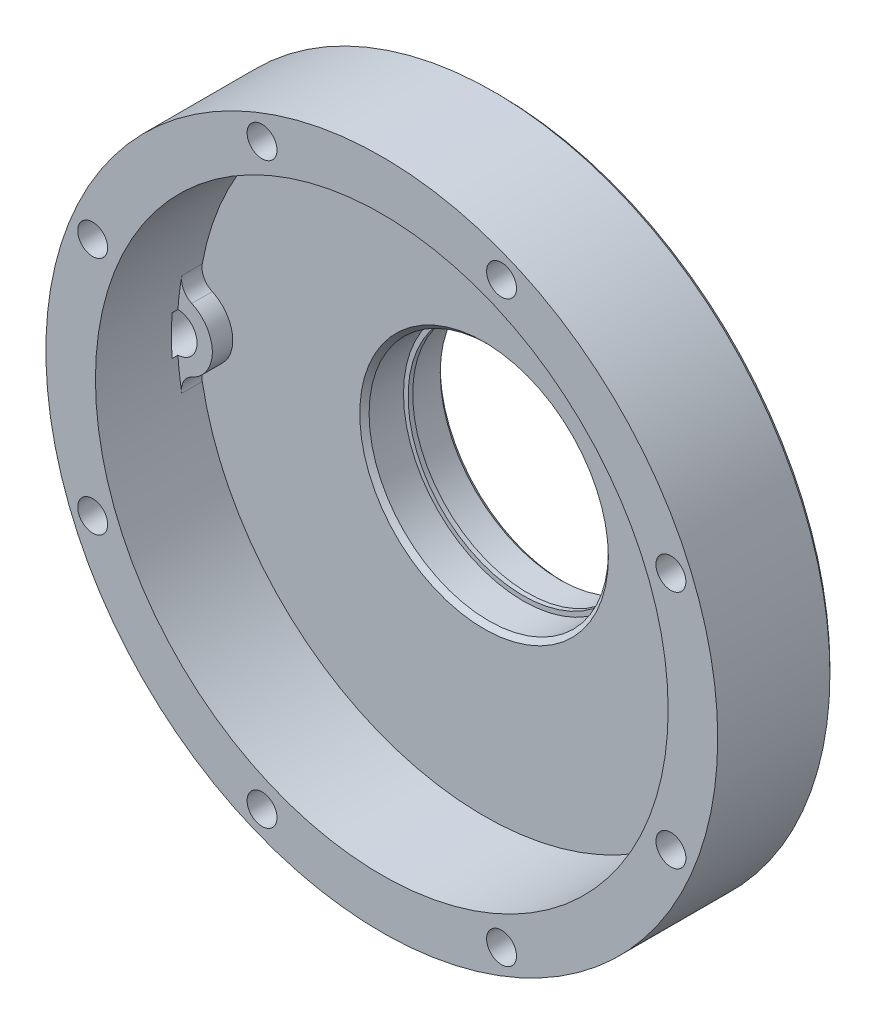
ISO-10303-21;
HEADER;
FILE_DESCRIPTION(('STEP AP214'),'2;1');
FILE_NAME('part.step','',(''),(''),'','','');
FILE_SCHEMA(('AUTOMOTIVE_DESIGN { 1 0 10303 214 1 1 1 1 }'));
ENDSEC;
DATA;
#1=APPLICATION_CONTEXT('core data for automotive mechanical design processes');
#2=APPLICATION_PROTOCOL_DEFINITION('international standard','automotive_design',2000,#1);
#3=PRODUCT_CONTEXT('',#1,'mechanical');
#4=PRODUCT('Part','Part','',(#3));
#5=PRODUCT_RELATED_PRODUCT_CATEGORY('part','',(#4));
#6=PRODUCT_DEFINITION_FORMATION('','',#4);
#7=PRODUCT_DEFINITION_CONTEXT('part definition',#1,'design');
#8=PRODUCT_DEFINITION('design','',#6,#7);
#9=PRODUCT_DEFINITION_SHAPE('','',#8);
#10=(LENGTH_UNIT() NAMED_UNIT(*) SI_UNIT(.MILLI.,.METRE.));
#11=(NAMED_UNIT(*) PLANE_ANGLE_UNIT() SI_UNIT($,.RADIAN.));
#12=(NAMED_UNIT(*) SI_UNIT($,.STERADIAN.) SOLID_ANGLE_UNIT());
#13=UNCERTAINTY_MEASURE_WITH_UNIT(LENGTH_MEASURE(1.E-05),#10,'distance_accuracy_value','');
#14=(GEOMETRIC_REPRESENTATION_CONTEXT(3) GLOBAL_UNCERTAINTY_ASSIGNED_CONTEXT((#13)) GLOBAL_UNIT_ASSIGNED_CONTEXT((#10,
#11,#12)) REPRESENTATION_CONTEXT('',''));
#15=CARTESIAN_POINT('',(0.,0.,0.));
#16=DIRECTION('',(0.,0.,1.));
#17=DIRECTION('',(1.,0.,0.));
#18=AXIS2_PLACEMENT_3D('',#15,#16,#17);
#19=CARTESIAN_POINT('',(0.,0.,-11.6725321845407));
#20=DIRECTION('',(0.,0.,-1.));
#21=DIRECTION('',(-1.,0.,0.));
#22=AXIS2_PLACEMENT_3D('',#19,#20,#21);
#23=PLANE('',#22);
#24=CARTESIAN_POINT('',(-10.3994360530147,57.4869387755102,-11.6725321845407));
#25=DIRECTION('',(0.,0.,1.));
#26=DIRECTION('',(1.,0.,0.));
#27=AXIS2_PLACEMENT_3D('',#24,#25,#26);
#28=CIRCLE('',#27,3.80999999999999);
#29=CARTESIAN_POINT('',(-11.0776601434287,61.2360869565217,-11.6725321845407));
#30=VERTEX_POINT('',#29);
#31=CARTESIAN_POINT('',(-6.93295736867645,59.0679591836735,-11.6725321845407));
#32=VERTEX_POINT('',#31);
#33=EDGE_CURVE('E52',#30,#32,#28,.F.);
#34=ORIENTED_EDGE('',*,*,#33,.T.);
#35=CARTESIAN_POINT('',(0.,62.23,-11.6725321845407));
#36=DIRECTION('',(0.,0.,1.));
#37=DIRECTION('',(1.,0.,0.));
#38=AXIS2_PLACEMENT_3D('',#35,#36,#37);
#39=CIRCLE('',#38,7.62);
#40=CARTESIAN_POINT('',(6.93295736867645,59.0679591836735,-11.6725321845407));
#41=VERTEX_POINT('',#40);
#42=EDGE_CURVE('E288',#32,#41,#39,.T.);
#43=ORIENTED_EDGE('',*,*,#42,.T.);
#44=CARTESIAN_POINT('',(10.3994360530147,57.4869387755102,-11.6725321845407));
#45=DIRECTION('',(0.,0.,1.));
#46=DIRECTION('',(1.,0.,0.));
#47=AXIS2_PLACEMENT_3D('',#44,#45,#46);
#48=CIRCLE('',#47,3.80999999999999);
#49=CARTESIAN_POINT('',(11.0776601434287,61.2360869565217,-11.6725321845407));
#50=VERTEX_POINT('',#49);
#51=EDGE_CURVE('E303',#50,#41,#48,.T.);
#52=ORIENTED_EDGE('',*,*,#51,.F.);
#53=CARTESIAN_POINT('',(0.,0.,-11.6725321845407));
#54=DIRECTION('',(0.,0.,1.));
#55=DIRECTION('',(1.,0.,0.));
#56=AXIS2_PLACEMENT_3D('',#53,#54,#55);
#57=CIRCLE('',#56,62.23);
#58=CARTESIAN_POINT('',(4.30272337838614,62.0810717653061,-11.6725321845407));
#59=VERTEX_POINT('',#58);
#60=EDGE_CURVE('E157',#50,#59,#57,.T.);
#61=ORIENTED_EDGE('',*,*,#60,.T.);
#62=CARTESIAN_POINT('',(0.,62.23,-11.6725321845407));
#63=DIRECTION('',(0.,0.,-1.));
#64=DIRECTION('',(-1.,0.,0.));
#65=AXIS2_PLACEMENT_3D('',#62,#63,#64);
#66=CIRCLE('',#65,4.30530000000001);
#67=CARTESIAN_POINT('',(-4.30272337838614,62.0810717653061,-11.6725321845407));
#68=VERTEX_POINT('',#67);
#69=EDGE_CURVE('E267',#59,#68,#66,.T.);
#70=ORIENTED_EDGE('',*,*,#69,.T.);
#71=EDGE_CURVE('E154',#68,#30,#57,.T.);
#72=ORIENTED_EDGE('',*,*,#71,.T.);
#73=EDGE_LOOP('',(#34,#43,#52,#61,#70,#72));
#74=FACE_BOUND('',#73,.T.);
#75=ADVANCED_FACE('F37',(#74),#23,.F.);
#76=CARTESIAN_POINT('',(0.,0.,0.));
#77=DIRECTION('',(0.,0.,1.));
#78=DIRECTION('',(1.,0.,0.));
#79=AXIS2_PLACEMENT_3D('',#76,#77,#78);
#80=CYLINDRICAL_SURFACE('',#79,62.23);
#81=DIRECTION('',(0.,0.,-1.));
#82=VECTOR('',#81,1.);
#83=CARTESIAN_POINT('',(-62.0810717653061,-4.30272337838618,-14.8475321845407));
#84=LINE('',#83,#82);
#85=CARTESIAN_POINT('',(-62.0810717653061,-4.30272337838619,-10.4025321845407));
#86=VERTEX_POINT('',#85);
#87=CARTESIAN_POINT('',(-62.0810717653061,-4.30272337838614,-11.6725321845407));
#88=VERTEX_POINT('',#87);
#89=EDGE_CURVE('E60',#86,#88,#84,.T.);
#90=ORIENTED_EDGE('',*,*,#89,.F.);
#91=CARTESIAN_POINT('',(0.,0.,-10.4025321845407));
#92=DIRECTION('',(0.,0.,-1.));
#93=DIRECTION('',(-1.,0.,0.));
#94=AXIS2_PLACEMENT_3D('',#91,#92,#93);
#95=CIRCLE('',#94,62.23);
#96=CARTESIAN_POINT('',(-62.0810717653061,4.30272337838619,-10.4025321845407));
#97=VERTEX_POINT('',#96);
#98=EDGE_CURVE('E11',#86,#97,#95,.T.);
#99=ORIENTED_EDGE('',*,*,#98,.T.);
#100=DIRECTION('',(0.,0.,-1.));
#101=VECTOR('',#100,1.);
#102=CARTESIAN_POINT('',(-62.0810717653061,4.30272337838618,-14.8475321845407));
#103=LINE('',#102,#101);
#104=CARTESIAN_POINT('',(-62.0810717653061,4.30272337838614,-11.6725321845407));
#105=VERTEX_POINT('',#104);
#106=EDGE_CURVE('E153',#105,#97,#103,.F.);
#107=ORIENTED_EDGE('',*,*,#106,.F.);
#108=CARTESIAN_POINT('',(-61.2360869565217,11.0776601434287,-11.6725321845407));
#109=VERTEX_POINT('',#108);
#110=EDGE_CURVE('E145',#109,#105,#57,.T.);
#111=ORIENTED_EDGE('',*,*,#110,.F.);
#112=DIRECTION('',(0.,0.,1.));
#113=VECTOR('',#112,1.);
#114=CARTESIAN_POINT('',(-61.2360869565217,11.0776601434287,-190.811004319298));
#115=LINE('',#114,#113);
#116=CARTESIAN_POINT('',(-61.2360869565217,11.0776601434287,-16.1175321845407));
#117=VERTEX_POINT('',#116);
#118=EDGE_CURVE('E129',#117,#109,#115,.T.);
#119=ORIENTED_EDGE('',*,*,#118,.F.);
#120=CARTESIAN_POINT('',(0.,0.,-16.1175321845407));
#121=DIRECTION('',(0.,0.,1.));
#122=DIRECTION('',(1.,0.,0.));
#123=AXIS2_PLACEMENT_3D('',#120,#121,#122);
#124=CIRCLE('',#123,62.23);
#125=CARTESIAN_POINT('',(-11.0776601434287,61.2360869565217,-16.1175321845407));
#126=VERTEX_POINT('',#125);
#127=EDGE_CURVE('E283',#117,#126,#124,.F.);
#128=ORIENTED_EDGE('',*,*,#127,.T.);
#129=DIRECTION('',(0.,0.,1.));
#130=VECTOR('',#129,1.);
#131=CARTESIAN_POINT('',(-11.0776601434287,61.2360869565217,-190.811004319298));
#132=LINE('',#131,#130);
#133=EDGE_CURVE('E140',#126,#30,#132,.T.);
#134=ORIENTED_EDGE('',*,*,#133,.T.);
#135=ORIENTED_EDGE('',*,*,#71,.F.);
#136=DIRECTION('',(0.,0.,-1.));
#137=VECTOR('',#136,1.);
#138=CARTESIAN_POINT('',(-4.30272337838618,62.0810717653061,-14.8475321845407));
#139=LINE('',#138,#137);
#140=CARTESIAN_POINT('',(-4.30272337838618,62.0810717653061,-10.4025321845407));
#141=VERTEX_POINT('',#140);
#142=EDGE_CURVE('E263',#141,#68,#139,.T.);
#143=ORIENTED_EDGE('',*,*,#142,.F.);
#144=CARTESIAN_POINT('',(0.,0.,-10.4025321845407));
#145=DIRECTION('',(0.,0.,-1.));
#146=DIRECTION('',(-1.,0.,0.));
#147=AXIS2_PLACEMENT_3D('',#144,#145,#146);
#148=CIRCLE('',#147,62.23);
#149=CARTESIAN_POINT('',(4.30272337838618,62.0810717653061,-10.4025321845407));
#150=VERTEX_POINT('',#149);
#151=EDGE_CURVE('E45',#141,#150,#148,.T.);
#152=ORIENTED_EDGE('',*,*,#151,.T.);
#153=DIRECTION('',(0.,0.,-1.));
#154=VECTOR('',#153,1.);
#155=CARTESIAN_POINT('',(4.30272337838618,62.0810717653061,-14.8475321845407));
#156=LINE('',#155,#154);
#157=EDGE_CURVE('E265',#59,#150,#156,.F.);
#158=ORIENTED_EDGE('',*,*,#157,.F.);
#159=ORIENTED_EDGE('',*,*,#60,.F.);
#160=DIRECTION('',(0.,0.,1.));
#161=VECTOR('',#160,1.);
#162=CARTESIAN_POINT('',(11.0776601434287,61.2360869565217,-190.811004319298));
#163=LINE('',#162,#161);
#164=CARTESIAN_POINT('',(11.0776601434287,61.2360869565217,-16.1175321845407));
#165=VERTEX_POINT('',#164);
#166=EDGE_CURVE('E295',#165,#50,#163,.T.);
#167=ORIENTED_EDGE('',*,*,#166,.F.);
#168=CARTESIAN_POINT('',(0.,0.,-16.1175321845407));
#169=DIRECTION('',(0.,0.,1.));
#170=DIRECTION('',(1.,0.,0.));
#171=AXIS2_PLACEMENT_3D('',#168,#169,#170);
#172=CIRCLE('',#171,62.23);
#173=CARTESIAN_POINT('',(-61.2360869565217,-11.0776601434286,-16.1175321845407));
#174=VERTEX_POINT('',#173);
#175=EDGE_CURVE('E317',#165,#174,#172,.F.);
#176=ORIENTED_EDGE('',*,*,#175,.T.);
#177=DIRECTION('',(0.,0.,1.));
#178=VECTOR('',#177,1.);
#179=CARTESIAN_POINT('',(-61.2360869565217,-11.0776601434286,-190.811004319298));
#180=LINE('',#179,#178);
#181=CARTESIAN_POINT('',(-61.2360869565217,-11.0776601434286,-11.6725321845407));
#182=VERTEX_POINT('',#181);
#183=EDGE_CURVE('E293',#174,#182,#180,.T.);
#184=ORIENTED_EDGE('',*,*,#183,.T.);
#185=EDGE_CURVE('E155',#88,#182,#57,.T.);
#186=ORIENTED_EDGE('',*,*,#185,.F.);
#187=EDGE_LOOP('',(#90,#99,#107,#111,#119,#128,#134,#135,#143,#152,#158,#159,#167,#176,#184,#186));
#188=FACE_BOUND('',#187,.T.);
#189=CARTESIAN_POINT('',(0.,0.,6.10746781545934));
#190=DIRECTION('',(0.,0.,1.));
#191=DIRECTION('',(1.,0.,0.));
#192=AXIS2_PLACEMENT_3D('',#189,#190,#191);
#193=CIRCLE('',#192,62.23);
#194=CARTESIAN_POINT('',(62.23,0.,6.10746781545934));
#195=VERTEX_POINT('',#194);
#196=EDGE_CURVE('E212',#195,#195,#193,.T.);
#197=ORIENTED_EDGE('',*,*,#196,.T.);
#198=EDGE_LOOP('',(#197));
#199=FACE_BOUND('',#198,.T.);
#200=ADVANCED_FACE('F39',(#188,#199),#80,.F.);
#201=ORIENTED_EDGE('',*,*,#185,.T.);
#202=CARTESIAN_POINT('',(-57.4869387755102,-10.3994360530147,-11.6725321845407));
#203=DIRECTION('',(0.,0.,1.));
#204=DIRECTION('',(1.,0.,0.));
#205=AXIS2_PLACEMENT_3D('',#202,#203,#204);
#206=CIRCLE('',#205,3.80999999999999);
#207=CARTESIAN_POINT('',(-59.0679591836735,-6.93295736867645,-11.6725321845407));
#208=VERTEX_POINT('',#207);
#209=EDGE_CURVE('E306',#208,#182,#206,.T.);
#210=ORIENTED_EDGE('',*,*,#209,.F.);
#211=CARTESIAN_POINT('',(-62.23,0.,-11.6725321845407));
#212=DIRECTION('',(0.,0.,1.));
#213=DIRECTION('',(1.,0.,0.));
#214=AXIS2_PLACEMENT_3D('',#211,#212,#213);
#215=CIRCLE('',#214,7.62);
#216=CARTESIAN_POINT('',(-59.0679591836735,6.93295736867645,-11.6725321845407));
#217=VERTEX_POINT('',#216);
#218=EDGE_CURVE('E148',#208,#217,#215,.T.);
#219=ORIENTED_EDGE('',*,*,#218,.T.);
#220=CARTESIAN_POINT('',(-57.4869387755102,10.3994360530147,-11.6725321845407));
#221=DIRECTION('',(0.,0.,1.));
#222=DIRECTION('',(1.,0.,0.));
#223=AXIS2_PLACEMENT_3D('',#220,#221,#222);
#224=CIRCLE('',#223,3.80999999999999);
#225=EDGE_CURVE('E133',#109,#217,#224,.T.);
#226=ORIENTED_EDGE('',*,*,#225,.F.);
#227=ORIENTED_EDGE('',*,*,#110,.T.);
#228=CARTESIAN_POINT('',(-62.23,0.,-11.6725321845407));
#229=DIRECTION('',(0.,0.,-1.));
#230=DIRECTION('',(-1.,0.,0.));
#231=AXIS2_PLACEMENT_3D('',#228,#229,#230);
#232=CIRCLE('',#231,4.30530000000001);
#233=EDGE_CURVE('E277',#105,#88,#232,.T.);
#234=ORIENTED_EDGE('',*,*,#233,.T.);
#235=EDGE_LOOP('',(#201,#210,#219,#226,#227,#234));
#236=FACE_BOUND('',#235,.T.);
#237=ADVANCED_FACE('F144',(#236),#23,.F.);
#238=CARTESIAN_POINT('',(0.,0.,-16.1175321845407));
#239=DIRECTION('',(0.,0.,1.));
#240=DIRECTION('',(1.,0.,0.));
#241=AXIS2_PLACEMENT_3D('',#238,#239,#240);
#242=PLANE('',#241);
#243=CARTESIAN_POINT('',(10.3994360530147,57.4869387755102,-16.1175321845407));
#244=DIRECTION('',(0.,0.,1.));
#245=DIRECTION('',(1.,0.,0.));
#246=AXIS2_PLACEMENT_3D('',#243,#244,#245);
#247=CIRCLE('',#246,3.80999999999999);
#248=CARTESIAN_POINT('',(6.93295736867645,59.0679591836735,-16.1175321845407));
#249=VERTEX_POINT('',#248);
#250=EDGE_CURVE('E315',#249,#165,#247,.F.);
#251=ORIENTED_EDGE('',*,*,#250,.F.);
#252=CARTESIAN_POINT('',(0.,62.23,-16.1175321845407));
#253=DIRECTION('',(0.,0.,1.));
#254=DIRECTION('',(1.,0.,0.));
#255=AXIS2_PLACEMENT_3D('',#252,#253,#254);
#256=CIRCLE('',#255,7.62);
#257=CARTESIAN_POINT('',(-6.93295736867645,59.0679591836735,-16.1175321845407));
#258=VERTEX_POINT('',#257);
#259=EDGE_CURVE('E313',#249,#258,#256,.F.);
#260=ORIENTED_EDGE('',*,*,#259,.T.);
#261=CARTESIAN_POINT('',(-10.3994360530147,57.4869387755102,-16.1175321845407));
#262=DIRECTION('',(0.,0.,1.));
#263=DIRECTION('',(1.,0.,0.));
#264=AXIS2_PLACEMENT_3D('',#261,#262,#263);
#265=CIRCLE('',#264,3.80999999999999);
#266=EDGE_CURVE('E287',#258,#126,#265,.T.);
#267=ORIENTED_EDGE('',*,*,#266,.T.);
#268=ORIENTED_EDGE('',*,*,#127,.F.);
#269=CARTESIAN_POINT('',(-57.4869387755102,10.3994360530147,-16.1175321845407));
#270=DIRECTION('',(0.,0.,1.));
#271=DIRECTION('',(1.,0.,0.));
#272=AXIS2_PLACEMENT_3D('',#269,#270,#271);
#273=CIRCLE('',#272,3.80999999999999);
#274=CARTESIAN_POINT('',(-59.0679591836735,6.93295736867645,-16.1175321845407));
#275=VERTEX_POINT('',#274);
#276=EDGE_CURVE('E135',#275,#117,#273,.F.);
#277=ORIENTED_EDGE('',*,*,#276,.F.);
#278=CARTESIAN_POINT('',(-62.23,0.,-16.1175321845407));
#279=DIRECTION('',(0.,0.,1.));
#280=DIRECTION('',(1.,0.,0.));
#281=AXIS2_PLACEMENT_3D('',#278,#279,#280);
#282=CIRCLE('',#281,7.62);
#283=CARTESIAN_POINT('',(-59.0679591836735,-6.93295736867645,-16.1175321845407));
#284=VERTEX_POINT('',#283);
#285=EDGE_CURVE('E322',#275,#284,#282,.F.);
#286=ORIENTED_EDGE('',*,*,#285,.T.);
#287=CARTESIAN_POINT('',(-57.4869387755102,-10.3994360530147,-16.1175321845407));
#288=DIRECTION('',(0.,0.,1.));
#289=DIRECTION('',(1.,0.,0.));
#290=AXIS2_PLACEMENT_3D('',#287,#288,#289);
#291=CIRCLE('',#290,3.80999999999999);
#292=EDGE_CURVE('E319',#174,#284,#291,.F.);
#293=ORIENTED_EDGE('',*,*,#292,.F.);
#294=ORIENTED_EDGE('',*,*,#175,.F.);
#295=EDGE_LOOP('',(#251,#260,#267,#268,#277,#286,#293,#294));
#296=FACE_BOUND('',#295,.T.);
#297=CARTESIAN_POINT('',(0.,0.,-16.1175321845407));
#298=DIRECTION('',(0.,0.,1.));
#299=DIRECTION('',(1.,0.,0.));
#300=AXIS2_PLACEMENT_3D('',#297,#298,#299);
#301=CIRCLE('',#300,27.016);
#302=CARTESIAN_POINT('',(27.016,0.,-16.1175321845407));
#303=VERTEX_POINT('',#302);
#304=EDGE_CURVE('E160',#303,#303,#301,.T.);
#305=ORIENTED_EDGE('',*,*,#304,.F.);
#306=EDGE_LOOP('',(#305));
#307=FACE_BOUND('',#306,.T.);
#308=ADVANCED_FACE('F327',(#296,#307),#242,.T.);
#309=CARTESIAN_POINT('',(0.,0.,-17.1335321845407));
#310=DIRECTION('',(0.,0.,1.));
#311=DIRECTION('',(1.,0.,0.));
#312=AXIS2_PLACEMENT_3D('',#309,#310,#311);
#313=CONICAL_SURFACE('',#312,26.,0.785398163397447);
#314=ORIENTED_EDGE('',*,*,#304,.T.);
#315=EDGE_LOOP('',(#314));
#316=FACE_BOUND('',#315,.T.);
#317=CARTESIAN_POINT('',(0.,0.,-17.1335321845407));
#318=DIRECTION('',(0.,0.,1.));
#319=DIRECTION('',(1.,0.,0.));
#320=AXIS2_PLACEMENT_3D('',#317,#318,#319);
#321=CIRCLE('',#320,26.);
#322=CARTESIAN_POINT('',(26.,0.,-17.1335321845407));
#323=VERTEX_POINT('',#322);
#324=EDGE_CURVE('E167',#323,#323,#321,.T.);
#325=ORIENTED_EDGE('',*,*,#324,.F.);
#326=EDGE_LOOP('',(#325));
#327=FACE_BOUND('',#326,.T.);
#328=ADVANCED_FACE('F377',(#316,#327),#313,.F.);
#329=CARTESIAN_POINT('',(0.,0.,0.));
#330=DIRECTION('',(0.,0.,1.));
#331=DIRECTION('',(1.,0.,0.));
#332=AXIS2_PLACEMENT_3D('',#329,#330,#331);
#333=CYLINDRICAL_SURFACE('',#332,26.);
#334=ORIENTED_EDGE('',*,*,#324,.T.);
#335=EDGE_LOOP('',(#334));
#336=FACE_BOUND('',#335,.T.);
#337=CARTESIAN_POINT('',(0.,0.,-24.6050321845406));
#338=DIRECTION('',(0.,0.,1.));
#339=DIRECTION('',(1.,0.,0.));
#340=AXIS2_PLACEMENT_3D('',#337,#338,#339);
#341=CIRCLE('',#340,26.);
#342=CARTESIAN_POINT('',(26.,0.,-24.6050321845406));
#343=VERTEX_POINT('',#342);
#344=EDGE_CURVE('E171',#343,#343,#341,.T.);
#345=ORIENTED_EDGE('',*,*,#344,.F.);
#346=EDGE_LOOP('',(#345));
#347=FACE_BOUND('',#346,.T.);
#348=ADVANCED_FACE('F381',(#336,#347),#333,.F.);
#349=CARTESIAN_POINT('',(0.,0.,-24.6050321845406));
#350=DIRECTION('',(0.,0.,-1.));
#351=DIRECTION('',(-1.,0.,0.));
#352=AXIS2_PLACEMENT_3D('',#349,#350,#351);
#353=PLANE('',#352);
#354=CARTESIAN_POINT('',(0.,0.,-24.6050321845406));
#355=DIRECTION('',(0.,0.,1.));
#356=DIRECTION('',(1.,0.,0.));
#357=AXIS2_PLACEMENT_3D('',#354,#355,#356);
#358=CIRCLE('',#357,25.);
#359=CARTESIAN_POINT('',(25.,0.,-24.6050321845406));
#360=VERTEX_POINT('',#359);
#361=EDGE_CURVE('E176',#360,#360,#358,.T.);
#362=ORIENTED_EDGE('',*,*,#361,.F.);
#363=EDGE_LOOP('',(#362));
#364=FACE_BOUND('',#363,.T.);
#365=ORIENTED_EDGE('',*,*,#344,.T.);
#366=EDGE_LOOP('',(#365));
#367=FACE_BOUND('',#366,.T.);
#368=ADVANCED_FACE('F386',(#364,#367),#353,.F.);
#369=CARTESIAN_POINT('',(0.,0.,0.));
#370=DIRECTION('',(0.,0.,1.));
#371=DIRECTION('',(1.,0.,0.));
#372=AXIS2_PLACEMENT_3D('',#369,#370,#371);
#373=CYLINDRICAL_SURFACE('',#372,25.);
#374=CARTESIAN_POINT('',(0.,0.,-25.6050321845406));
#375=DIRECTION('',(0.,0.,1.));
#376=DIRECTION('',(1.,0.,0.));
#377=AXIS2_PLACEMENT_3D('',#374,#375,#376);
#378=CIRCLE('',#377,25.);
#379=CARTESIAN_POINT('',(25.,0.,-25.6050321845406));
#380=VERTEX_POINT('',#379);
#381=EDGE_CURVE('E179',#380,#380,#378,.T.);
#382=ORIENTED_EDGE('',*,*,#381,.F.);
#383=EDGE_LOOP('',(#382));
#384=FACE_BOUND('',#383,.T.);
#385=ORIENTED_EDGE('',*,*,#361,.T.);
#386=EDGE_LOOP('',(#385));
#387=FACE_BOUND('',#386,.T.);
#388=ADVANCED_FACE('F390',(#384,#387),#373,.F.);
#389=CARTESIAN_POINT('',(0.,0.,-25.6050321845406));
#390=DIRECTION('',(0.,0.,1.));
#391=DIRECTION('',(1.,0.,0.));
#392=AXIS2_PLACEMENT_3D('',#389,#390,#391);
#393=PLANE('',#392);
#394=CARTESIAN_POINT('',(0.,0.,-25.6050321845406));
#395=DIRECTION('',(0.,0.,1.));
#396=DIRECTION('',(1.,0.,0.));
#397=AXIS2_PLACEMENT_3D('',#394,#395,#396);
#398=CIRCLE('',#397,26.);
#399=CARTESIAN_POINT('',(26.,0.,-25.6050321845406));
#400=VERTEX_POINT('',#399);
#401=EDGE_CURVE('E182',#400,#400,#398,.T.);
#402=ORIENTED_EDGE('',*,*,#401,.F.);
#403=EDGE_LOOP('',(#402));
#404=FACE_BOUND('',#403,.T.);
#405=ORIENTED_EDGE('',*,*,#381,.T.);
#406=EDGE_LOOP('',(#405));
#407=FACE_BOUND('',#406,.T.);
#408=ADVANCED_FACE('F394',(#404,#407),#393,.F.);
#409=CARTESIAN_POINT('',(0.,0.,0.));
#410=DIRECTION('',(0.,0.,1.));
#411=DIRECTION('',(1.,0.,0.));
#412=AXIS2_PLACEMENT_3D('',#409,#410,#411);
#413=CYLINDRICAL_SURFACE('',#412,26.);
#414=CARTESIAN_POINT('',(0.,0.,-32.5890321845406));
#415=DIRECTION('',(0.,0.,1.));
#416=DIRECTION('',(1.,0.,0.));
#417=AXIS2_PLACEMENT_3D('',#414,#415,#416);
#418=CIRCLE('',#417,26.);
#419=CARTESIAN_POINT('',(26.,0.,-32.5890321845406));
#420=VERTEX_POINT('',#419);
#421=EDGE_CURVE('E185',#420,#420,#418,.T.);
#422=ORIENTED_EDGE('',*,*,#421,.F.);
#423=EDGE_LOOP('',(#422));
#424=FACE_BOUND('',#423,.T.);
#425=ORIENTED_EDGE('',*,*,#401,.T.);
#426=EDGE_LOOP('',(#425));
#427=FACE_BOUND('',#426,.T.);
#428=ADVANCED_FACE('F398',(#424,#427),#413,.F.);
#429=CARTESIAN_POINT('',(0.,0.,-32.5890321845406));
#430=DIRECTION('',(0.,0.,-1.));
#431=DIRECTION('',(-1.,0.,0.));
#432=AXIS2_PLACEMENT_3D('',#429,#430,#431);
#433=CONICAL_SURFACE('',#432,26.,0.785398163397447);
#434=CARTESIAN_POINT('',(0.,0.,-33.6050321845406));
#435=DIRECTION('',(0.,0.,1.));
#436=DIRECTION('',(1.,0.,0.));
#437=AXIS2_PLACEMENT_3D('',#434,#435,#436);
#438=CIRCLE('',#437,27.016);
#439=CARTESIAN_POINT('',(27.016,0.,-33.6050321845406));
#440=VERTEX_POINT('',#439);
#441=EDGE_CURVE('E188',#440,#440,#438,.T.);
#442=ORIENTED_EDGE('',*,*,#441,.F.);
#443=EDGE_LOOP('',(#442));
#444=FACE_BOUND('',#443,.T.);
#445=ORIENTED_EDGE('',*,*,#421,.T.);
#446=EDGE_LOOP('',(#445));
#447=FACE_BOUND('',#446,.T.);
#448=ADVANCED_FACE('F402',(#444,#447),#433,.F.);
#449=CARTESIAN_POINT('',(0.,1.08004517353366E-13,-33.6050321845406));
#450=DIRECTION('',(0.,0.,1.));
#451=DIRECTION('',(1.,0.,0.));
#452=AXIS2_PLACEMENT_3D('',#449,#450,#451);
#453=PLANE('',#452);
#454=CARTESIAN_POINT('',(0.,0.,-33.6050321845406));
#455=DIRECTION('',(0.,0.,1.));
#456=DIRECTION('',(1.,0.,0.));
#457=AXIS2_PLACEMENT_3D('',#454,#455,#456);
#458=CIRCLE('',#457,31.334);
#459=CARTESIAN_POINT('',(31.334,0.,-33.6050321845406));
#460=VERTEX_POINT('',#459);
#461=EDGE_CURVE('E191',#460,#460,#458,.T.);
#462=ORIENTED_EDGE('',*,*,#461,.F.);
#463=EDGE_LOOP('',(#462));
#464=FACE_BOUND('',#463,.T.);
#465=ORIENTED_EDGE('',*,*,#441,.T.);
#466=EDGE_LOOP('',(#465));
#467=FACE_BOUND('',#466,.T.);
#468=ADVANCED_FACE('F406',(#464,#467),#453,.F.);
#469=CARTESIAN_POINT('',(0.,0.,-33.6050321845406));
#470=DIRECTION('',(0.,0.,1.));
#471=DIRECTION('',(1.,0.,0.));
#472=AXIS2_PLACEMENT_3D('',#469,#470,#471);
#473=CONICAL_SURFACE('',#472,31.334,0.785398163397452);
#474=CARTESIAN_POINT('',(0.,0.,-32.5890321845406));
#475=DIRECTION('',(0.,0.,1.));
#476=DIRECTION('',(1.,0.,0.));
#477=AXIS2_PLACEMENT_3D('',#474,#475,#476);
#478=CIRCLE('',#477,32.35);
#479=CARTESIAN_POINT('',(32.35,0.,-32.5890321845406));
#480=VERTEX_POINT('',#479);
#481=EDGE_CURVE('E194',#480,#480,#478,.T.);
#482=ORIENTED_EDGE('',*,*,#481,.F.);
#483=EDGE_LOOP('',(#482));
#484=FACE_BOUND('',#483,.T.);
#485=ORIENTED_EDGE('',*,*,#461,.T.);
#486=EDGE_LOOP('',(#485));
#487=FACE_BOUND('',#486,.T.);
#488=ADVANCED_FACE('F410',(#484,#487),#473,.T.);
#489=CARTESIAN_POINT('',(0.,0.,0.));
#490=DIRECTION('',(0.,0.,1.));
#491=DIRECTION('',(1.,0.,0.));
#492=AXIS2_PLACEMENT_3D('',#489,#490,#491);
#493=CYLINDRICAL_SURFACE('',#492,32.35);
#494=CARTESIAN_POINT('',(0.,0.,-22.4675321845407));
#495=DIRECTION('',(0.,0.,1.));
#496=DIRECTION('',(1.,0.,0.));
#497=AXIS2_PLACEMENT_3D('',#494,#495,#496);
#498=CIRCLE('',#497,32.35);
#499=CARTESIAN_POINT('',(32.35,0.,-22.4675321845407));
#500=VERTEX_POINT('',#499);
#501=EDGE_CURVE('E197',#500,#500,#498,.T.);
#502=ORIENTED_EDGE('',*,*,#501,.F.);
#503=EDGE_LOOP('',(#502));
#504=FACE_BOUND('',#503,.T.);
#505=ORIENTED_EDGE('',*,*,#481,.T.);
#506=EDGE_LOOP('',(#505));
#507=FACE_BOUND('',#506,.T.);
#508=ADVANCED_FACE('F414',(#504,#507),#493,.T.);
#509=CARTESIAN_POINT('',(0.,0.,-22.4675321845407));
#510=DIRECTION('',(0.,0.,1.));
#511=DIRECTION('',(1.,0.,0.));
#512=AXIS2_PLACEMENT_3D('',#509,#510,#511);
#513=TOROIDAL_SURFACE('',#512,35.525,3.175);
#514=ORIENTED_EDGE('',*,*,#501,.T.);
#515=EDGE_LOOP('',(#514));
#516=FACE_BOUND('',#515,.T.);
#517=CARTESIAN_POINT('',(0.,0.,-19.2925321845407));
#518=DIRECTION('',(0.,0.,1.));
#519=DIRECTION('',(1.,0.,0.));
#520=AXIS2_PLACEMENT_3D('',#517,#518,#519);
#521=CIRCLE('',#520,35.525);
#522=CARTESIAN_POINT('',(35.525,0.,-19.2925321845407));
#523=VERTEX_POINT('',#522);
#524=EDGE_CURVE('E200',#523,#523,#521,.T.);
#525=ORIENTED_EDGE('',*,*,#524,.F.);
#526=EDGE_LOOP('',(#525));
#527=FACE_BOUND('',#526,.T.);
#528=ADVANCED_FACE('F418',(#516,#527),#513,.F.);
#529=CARTESIAN_POINT('',(0.,0.,-19.2925321845407));
#530=DIRECTION('',(0.,0.,1.));
#531=DIRECTION('',(1.,0.,0.));
#532=AXIS2_PLACEMENT_3D('',#529,#530,#531);
#533=PLANE('',#532);
#534=CARTESIAN_POINT('',(-62.23,0.,-19.2925321845407));
#535=DIRECTION('',(0.,0.,-1.));
#536=DIRECTION('',(-1.,0.,0.));
#537=AXIS2_PLACEMENT_3D('',#534,#535,#536);
#538=CIRCLE('',#537,4.30530000000001);
#539=CARTESIAN_POINT('',(-66.5353,0.,-19.2925321845407));
#540=VERTEX_POINT('',#539);
#541=EDGE_CURVE('E280',#540,#540,#538,.T.);
#542=ORIENTED_EDGE('',*,*,#541,.F.);
#543=EDGE_LOOP('',(#542));
#544=FACE_BOUND('',#543,.T.);
#545=CARTESIAN_POINT('',(0.,62.23,-19.2925321845407));
#546=DIRECTION('',(0.,0.,-1.));
#547=DIRECTION('',(-1.,0.,0.));
#548=AXIS2_PLACEMENT_3D('',#545,#546,#547);
#549=CIRCLE('',#548,4.30530000000001);
#550=CARTESIAN_POINT('',(-4.30530000000001,62.23,-19.2925321845407));
#551=VERTEX_POINT('',#550);
#552=EDGE_CURVE('E270',#551,#551,#549,.T.);
#553=ORIENTED_EDGE('',*,*,#552,.F.);
#554=EDGE_LOOP('',(#553));
#555=FACE_BOUND('',#554,.T.);
#556=CARTESIAN_POINT('',(62.8238082107675,-26.0224734008262,-19.2925321845407));
#557=DIRECTION('',(0.,0.,1.));
#558=DIRECTION('',(1.,0.,0.));
#559=AXIS2_PLACEMENT_3D('',#556,#557,#558);
#560=CIRCLE('',#559,3.25000000000001);
#561=CARTESIAN_POINT('',(66.0738082107675,-26.0224734008262,-19.2925321845407));
#562=VERTEX_POINT('',#561);
#563=EDGE_CURVE('E257',#562,#562,#560,.T.);
#564=ORIENTED_EDGE('',*,*,#563,.T.);
#565=EDGE_LOOP('',(#564));
#566=FACE_BOUND('',#565,.T.);
#567=CARTESIAN_POINT('',(62.8238082107675,26.022473400826,-19.2925321845407));
#568=DIRECTION('',(0.,0.,1.));
#569=DIRECTION('',(1.,0.,0.));
#570=AXIS2_PLACEMENT_3D('',#567,#568,#569);
#571=CIRCLE('',#570,3.25000000000002);
#572=CARTESIAN_POINT('',(66.0738082107675,26.022473400826,-19.2925321845407));
#573=VERTEX_POINT('',#572);
#574=EDGE_CURVE('E251',#573,#573,#571,.T.);
#575=ORIENTED_EDGE('',*,*,#574,.T.);
#576=EDGE_LOOP('',(#575));
#577=FACE_BOUND('',#576,.T.);
#578=CARTESIAN_POINT('',(26.0224734008262,62.8238082107675,-19.2925321845407));
#579=DIRECTION('',(0.,0.,1.));
#580=DIRECTION('',(1.,0.,0.));
#581=AXIS2_PLACEMENT_3D('',#578,#579,#580);
#582=CIRCLE('',#581,3.25);
#583=CARTESIAN_POINT('',(29.2724734008262,62.8238082107675,-19.2925321845407));
#584=VERTEX_POINT('',#583);
#585=EDGE_CURVE('E245',#584,#584,#582,.T.);
#586=ORIENTED_EDGE('',*,*,#585,.T.);
#587=EDGE_LOOP('',(#586));
#588=FACE_BOUND('',#587,.T.);
#589=CARTESIAN_POINT('',(-26.0224734008261,62.8238082107675,-19.2925321845407));
#590=DIRECTION('',(0.,0.,1.));
#591=DIRECTION('',(1.,0.,0.));
#592=AXIS2_PLACEMENT_3D('',#589,#590,#591);
#593=CIRCLE('',#592,3.25);
#594=CARTESIAN_POINT('',(-22.7724734008261,62.8238082107675,-19.2925321845407));
#595=VERTEX_POINT('',#594);
#596=EDGE_CURVE('E239',#595,#595,#593,.T.);
#597=ORIENTED_EDGE('',*,*,#596,.T.);
#598=EDGE_LOOP('',(#597));
#599=FACE_BOUND('',#598,.T.);
#600=CARTESIAN_POINT('',(-62.8238082107675,26.0224734008261,-19.2925321845407));
#601=DIRECTION('',(0.,0.,1.));
#602=DIRECTION('',(1.,0.,0.));
#603=AXIS2_PLACEMENT_3D('',#600,#601,#602);
#604=CIRCLE('',#603,3.25);
#605=CARTESIAN_POINT('',(-59.5738082107675,26.0224734008261,-19.2925321845407));
#606=VERTEX_POINT('',#605);
#607=EDGE_CURVE('E233',#606,#606,#604,.T.);
#608=ORIENTED_EDGE('',*,*,#607,.T.);
#609=EDGE_LOOP('',(#608));
#610=FACE_BOUND('',#609,.T.);
#611=CARTESIAN_POINT('',(26.0224734008261,-62.8238082107675,-19.2925321845407));
#612=DIRECTION('',(0.,0.,1.));
#613=DIRECTION('',(1.,0.,0.));
#614=AXIS2_PLACEMENT_3D('',#611,#612,#613);
#615=CIRCLE('',#614,3.25000000000001);
#616=CARTESIAN_POINT('',(29.2724734008261,-62.8238082107675,-19.2925321845407));
#617=VERTEX_POINT('',#616);
#618=EDGE_CURVE('E227',#617,#617,#615,.T.);
#619=ORIENTED_EDGE('',*,*,#618,.T.);
#620=EDGE_LOOP('',(#619));
#621=FACE_BOUND('',#620,.T.);
#622=CARTESIAN_POINT('',(-26.0224734008261,-62.8238082107675,-19.2925321845407));
#623=DIRECTION('',(0.,0.,1.));
#624=DIRECTION('',(1.,0.,0.));
#625=AXIS2_PLACEMENT_3D('',#622,#623,#624);
#626=CIRCLE('',#625,3.25);
#627=CARTESIAN_POINT('',(-22.7724734008261,-62.8238082107675,-19.2925321845407));
#628=VERTEX_POINT('',#627);
#629=EDGE_CURVE('E221',#628,#628,#626,.T.);
#630=ORIENTED_EDGE('',*,*,#629,.T.);
#631=EDGE_LOOP('',(#630));
#632=FACE_BOUND('',#631,.T.);
#633=CARTESIAN_POINT('',(-62.8238082107675,-26.0224734008261,-19.2925321845407));
#634=DIRECTION('',(0.,0.,1.));
#635=DIRECTION('',(1.,0.,0.));
#636=AXIS2_PLACEMENT_3D('',#633,#634,#635);
#637=CIRCLE('',#636,3.24999999999999);
#638=CARTESIAN_POINT('',(-59.5738082107675,-26.0224734008261,-19.2925321845407));
#639=VERTEX_POINT('',#638);
#640=EDGE_CURVE('E215',#639,#639,#637,.T.);
#641=ORIENTED_EDGE('',*,*,#640,.T.);
#642=EDGE_LOOP('',(#641));
#643=FACE_BOUND('',#642,.T.);
#644=CARTESIAN_POINT('',(0.,0.,-19.2925321845407));
#645=DIRECTION('',(0.,0.,1.));
#646=DIRECTION('',(1.,0.,0.));
#647=AXIS2_PLACEMENT_3D('',#644,#645,#646);
#648=CIRCLE('',#647,71.984);
#649=CARTESIAN_POINT('',(71.984,0.,-19.2925321845407));
#650=VERTEX_POINT('',#649);
#651=EDGE_CURVE('E203',#650,#650,#648,.T.);
#652=ORIENTED_EDGE('',*,*,#651,.F.);
#653=EDGE_LOOP('',(#652));
#654=FACE_BOUND('',#653,.T.);
#655=ORIENTED_EDGE('',*,*,#524,.T.);
#656=EDGE_LOOP('',(#655));
#657=FACE_BOUND('',#656,.T.);
#658=ADVANCED_FACE('F422',(#544,#555,#566,#577,#588,#599,#610,#621,#632,#643,#654,#657),#533,.F.);
#659=CARTESIAN_POINT('',(0.,0.,-19.2925321845407));
#660=DIRECTION('',(0.,0.,1.));
#661=DIRECTION('',(1.,0.,0.));
#662=AXIS2_PLACEMENT_3D('',#659,#660,#661);
#663=CONICAL_SURFACE('',#662,71.984,0.78539816339745);
#664=CARTESIAN_POINT('',(0.,0.,-18.2765321845407));
#665=DIRECTION('',(0.,0.,1.));
#666=DIRECTION('',(1.,0.,0.));
#667=AXIS2_PLACEMENT_3D('',#664,#665,#666);
#668=CIRCLE('',#667,73.);
#669=CARTESIAN_POINT('',(73.,0.,-18.2765321845407));
#670=VERTEX_POINT('',#669);
#671=EDGE_CURVE('E206',#670,#670,#668,.T.);
#672=ORIENTED_EDGE('',*,*,#671,.F.);
#673=EDGE_LOOP('',(#672));
#674=FACE_BOUND('',#673,.T.);
#675=ORIENTED_EDGE('',*,*,#651,.T.);
#676=EDGE_LOOP('',(#675));
#677=FACE_BOUND('',#676,.T.);
#678=ADVANCED_FACE('F426',(#674,#677),#663,.T.);
#679=CARTESIAN_POINT('',(0.,0.,0.));
#680=DIRECTION('',(0.,0.,1.));
#681=DIRECTION('',(1.,0.,0.));
#682=AXIS2_PLACEMENT_3D('',#679,#680,#681);
#683=CYLINDRICAL_SURFACE('',#682,73.);
#684=ORIENTED_EDGE('',*,*,#671,.T.);
#685=EDGE_LOOP('',(#684));
#686=FACE_BOUND('',#685,.T.);
#687=CARTESIAN_POINT('',(0.,0.,6.10746781545934));
#688=DIRECTION('',(0.,0.,1.));
#689=DIRECTION('',(1.,0.,0.));
#690=AXIS2_PLACEMENT_3D('',#687,#688,#689);
#691=CIRCLE('',#690,73.);
#692=CARTESIAN_POINT('',(73.,0.,6.10746781545934));
#693=VERTEX_POINT('',#692);
#694=EDGE_CURVE('E209',#693,#693,#691,.T.);
#695=ORIENTED_EDGE('',*,*,#694,.F.);
#696=EDGE_LOOP('',(#695));
#697=FACE_BOUND('',#696,.T.);
#698=ADVANCED_FACE('F430',(#686,#697),#683,.T.);
#699=CARTESIAN_POINT('',(0.,0.,6.10746781545934));
#700=DIRECTION('',(0.,0.,1.));
#701=DIRECTION('',(1.,0.,0.));
#702=AXIS2_PLACEMENT_3D('',#699,#700,#701);
#703=PLANE('',#702);
#704=CARTESIAN_POINT('',(62.8238082107675,-26.0224734008262,6.10746781545934));
#705=DIRECTION('',(0.,0.,1.));
#706=DIRECTION('',(1.,0.,0.));
#707=AXIS2_PLACEMENT_3D('',#704,#705,#706);
#708=CIRCLE('',#707,3.25000000000001);
#709=CARTESIAN_POINT('',(66.0738082107675,-26.0224734008262,6.10746781545934));
#710=VERTEX_POINT('',#709);
#711=EDGE_CURVE('E260',#710,#710,#708,.T.);
#712=ORIENTED_EDGE('',*,*,#711,.F.);
#713=EDGE_LOOP('',(#712));
#714=FACE_BOUND('',#713,.T.);
#715=CARTESIAN_POINT('',(62.8238082107675,26.022473400826,6.10746781545934));
#716=DIRECTION('',(0.,0.,1.));
#717=DIRECTION('',(1.,0.,0.));
#718=AXIS2_PLACEMENT_3D('',#715,#716,#717);
#719=CIRCLE('',#718,3.25000000000002);
#720=CARTESIAN_POINT('',(66.0738082107675,26.022473400826,6.10746781545934));
#721=VERTEX_POINT('',#720);
#722=EDGE_CURVE('E254',#721,#721,#719,.T.);
#723=ORIENTED_EDGE('',*,*,#722,.F.);
#724=EDGE_LOOP('',(#723));
#725=FACE_BOUND('',#724,.T.);
#726=CARTESIAN_POINT('',(26.0224734008262,62.8238082107675,6.10746781545934));
#727=DIRECTION('',(0.,0.,1.));
#728=DIRECTION('',(1.,0.,0.));
#729=AXIS2_PLACEMENT_3D('',#726,#727,#728);
#730=CIRCLE('',#729,3.25);
#731=CARTESIAN_POINT('',(29.2724734008262,62.8238082107675,6.10746781545934));
#732=VERTEX_POINT('',#731);
#733=EDGE_CURVE('E248',#732,#732,#730,.T.);
#734=ORIENTED_EDGE('',*,*,#733,.F.);
#735=EDGE_LOOP('',(#734));
#736=FACE_BOUND('',#735,.T.);
#737=CARTESIAN_POINT('',(-26.0224734008261,62.8238082107675,6.10746781545934));
#738=DIRECTION('',(0.,0.,1.));
#739=DIRECTION('',(1.,0.,0.));
#740=AXIS2_PLACEMENT_3D('',#737,#738,#739);
#741=CIRCLE('',#740,3.25);
#742=CARTESIAN_POINT('',(-22.7724734008261,62.8238082107675,6.10746781545934));
#743=VERTEX_POINT('',#742);
#744=EDGE_CURVE('E242',#743,#743,#741,.T.);
#745=ORIENTED_EDGE('',*,*,#744,.F.);
#746=EDGE_LOOP('',(#745));
#747=FACE_BOUND('',#746,.T.);
#748=CARTESIAN_POINT('',(-62.8238082107675,26.0224734008261,6.10746781545934));
#749=DIRECTION('',(0.,0.,1.));
#750=DIRECTION('',(1.,0.,0.));
#751=AXIS2_PLACEMENT_3D('',#748,#749,#750);
#752=CIRCLE('',#751,3.25);
#753=CARTESIAN_POINT('',(-59.5738082107675,26.0224734008261,6.10746781545934));
#754=VERTEX_POINT('',#753);
#755=EDGE_CURVE('E236',#754,#754,#752,.T.);
#756=ORIENTED_EDGE('',*,*,#755,.F.);
#757=EDGE_LOOP('',(#756));
#758=FACE_BOUND('',#757,.T.);
#759=CARTESIAN_POINT('',(26.0224734008261,-62.8238082107675,6.10746781545934));
#760=DIRECTION('',(0.,0.,1.));
#761=DIRECTION('',(1.,0.,0.));
#762=AXIS2_PLACEMENT_3D('',#759,#760,#761);
#763=CIRCLE('',#762,3.25000000000001);
#764=CARTESIAN_POINT('',(29.2724734008261,-62.8238082107675,6.10746781545934));
#765=VERTEX_POINT('',#764);
#766=EDGE_CURVE('E230',#765,#765,#763,.T.);
#767=ORIENTED_EDGE('',*,*,#766,.F.);
#768=EDGE_LOOP('',(#767));
#769=FACE_BOUND('',#768,.T.);
#770=CARTESIAN_POINT('',(-26.0224734008261,-62.8238082107675,6.10746781545934));
#771=DIRECTION('',(0.,0.,1.));
#772=DIRECTION('',(1.,0.,0.));
#773=AXIS2_PLACEMENT_3D('',#770,#771,#772);
#774=CIRCLE('',#773,3.25);
#775=CARTESIAN_POINT('',(-22.7724734008261,-62.8238082107675,6.10746781545934));
#776=VERTEX_POINT('',#775);
#777=EDGE_CURVE('E224',#776,#776,#774,.T.);
#778=ORIENTED_EDGE('',*,*,#777,.F.);
#779=EDGE_LOOP('',(#778));
#780=FACE_BOUND('',#779,.T.);
#781=CARTESIAN_POINT('',(-62.8238082107675,-26.0224734008261,6.10746781545934));
#782=DIRECTION('',(0.,0.,1.));
#783=DIRECTION('',(1.,0.,0.));
#784=AXIS2_PLACEMENT_3D('',#781,#782,#783);
#785=CIRCLE('',#784,3.24999999999999);
#786=CARTESIAN_POINT('',(-59.5738082107675,-26.0224734008261,6.10746781545934));
#787=VERTEX_POINT('',#786);
#788=EDGE_CURVE('E218',#787,#787,#785,.T.);
#789=ORIENTED_EDGE('',*,*,#788,.F.);
#790=EDGE_LOOP('',(#789));
#791=FACE_BOUND('',#790,.T.);
#792=ORIENTED_EDGE('',*,*,#694,.T.);
#793=EDGE_LOOP('',(#792));
#794=FACE_BOUND('',#793,.T.);
#795=ORIENTED_EDGE('',*,*,#196,.F.);
#796=EDGE_LOOP('',(#795));
#797=FACE_BOUND('',#796,.T.);
#798=ADVANCED_FACE('F434',(#714,#725,#736,#747,#758,#769,#780,#791,#794,#797),#703,.T.);
#799=CARTESIAN_POINT('',(-62.8238082107675,-26.0224734008261,-33.6050321845406));
#800=DIRECTION('',(0.,0.,1.));
#801=DIRECTION('',(1.,0.,0.));
#802=AXIS2_PLACEMENT_3D('',#799,#800,#801);
#803=CYLINDRICAL_SURFACE('',#802,3.24999999999999);
#804=ORIENTED_EDGE('',*,*,#788,.T.);
#805=EDGE_LOOP('',(#804));
#806=FACE_BOUND('',#805,.T.);
#807=ORIENTED_EDGE('',*,*,#640,.F.);
#808=EDGE_LOOP('',(#807));
#809=FACE_BOUND('',#808,.T.);
#810=ADVANCED_FACE('F438',(#806,#809),#803,.F.);
#811=CARTESIAN_POINT('',(-26.0224734008261,-62.8238082107675,-33.6050321845406));
#812=DIRECTION('',(0.,0.,1.));
#813=DIRECTION('',(1.,0.,0.));
#814=AXIS2_PLACEMENT_3D('',#811,#812,#813);
#815=CYLINDRICAL_SURFACE('',#814,3.25);
#816=ORIENTED_EDGE('',*,*,#777,.T.);
#817=EDGE_LOOP('',(#816));
#818=FACE_BOUND('',#817,.T.);
#819=ORIENTED_EDGE('',*,*,#629,.F.);
#820=EDGE_LOOP('',(#819));
#821=FACE_BOUND('',#820,.T.);
#822=ADVANCED_FACE('F442',(#818,#821),#815,.F.);
#823=CARTESIAN_POINT('',(26.0224734008261,-62.8238082107675,-33.6050321845406));
#824=DIRECTION('',(0.,0.,1.));
#825=DIRECTION('',(1.,0.,0.));
#826=AXIS2_PLACEMENT_3D('',#823,#824,#825);
#827=CYLINDRICAL_SURFACE('',#826,3.25000000000001);
#828=ORIENTED_EDGE('',*,*,#766,.T.);
#829=EDGE_LOOP('',(#828));
#830=FACE_BOUND('',#829,.T.);
#831=ORIENTED_EDGE('',*,*,#618,.F.);
#832=EDGE_LOOP('',(#831));
#833=FACE_BOUND('',#832,.T.);
#834=ADVANCED_FACE('F446',(#830,#833),#827,.F.);
#835=CARTESIAN_POINT('',(-62.8238082107675,26.0224734008261,-33.6050321845406));
#836=DIRECTION('',(0.,0.,1.));
#837=DIRECTION('',(1.,0.,0.));
#838=AXIS2_PLACEMENT_3D('',#835,#836,#837);
#839=CYLINDRICAL_SURFACE('',#838,3.25);
#840=ORIENTED_EDGE('',*,*,#755,.T.);
#841=EDGE_LOOP('',(#840));
#842=FACE_BOUND('',#841,.T.);
#843=ORIENTED_EDGE('',*,*,#607,.F.);
#844=EDGE_LOOP('',(#843));
#845=FACE_BOUND('',#844,.T.);
#846=ADVANCED_FACE('F450',(#842,#845),#839,.F.);
#847=CARTESIAN_POINT('',(-26.0224734008261,62.8238082107675,-33.6050321845406));
#848=DIRECTION('',(0.,0.,1.));
#849=DIRECTION('',(1.,0.,0.));
#850=AXIS2_PLACEMENT_3D('',#847,#848,#849);
#851=CYLINDRICAL_SURFACE('',#850,3.25);
#852=ORIENTED_EDGE('',*,*,#744,.T.);
#853=EDGE_LOOP('',(#852));
#854=FACE_BOUND('',#853,.T.);
#855=ORIENTED_EDGE('',*,*,#596,.F.);
#856=EDGE_LOOP('',(#855));
#857=FACE_BOUND('',#856,.T.);
#858=ADVANCED_FACE('F454',(#854,#857),#851,.F.);
#859=CARTESIAN_POINT('',(26.0224734008262,62.8238082107675,-33.6050321845406));
#860=DIRECTION('',(0.,0.,1.));
#861=DIRECTION('',(1.,0.,0.));
#862=AXIS2_PLACEMENT_3D('',#859,#860,#861);
#863=CYLINDRICAL_SURFACE('',#862,3.25);
#864=ORIENTED_EDGE('',*,*,#733,.T.);
#865=EDGE_LOOP('',(#864));
#866=FACE_BOUND('',#865,.T.);
#867=ORIENTED_EDGE('',*,*,#585,.F.);
#868=EDGE_LOOP('',(#867));
#869=FACE_BOUND('',#868,.T.);
#870=ADVANCED_FACE('F458',(#866,#869),#863,.F.);
#871=CARTESIAN_POINT('',(62.8238082107675,26.022473400826,-33.6050321845406));
#872=DIRECTION('',(0.,0.,1.));
#873=DIRECTION('',(1.,0.,0.));
#874=AXIS2_PLACEMENT_3D('',#871,#872,#873);
#875=CYLINDRICAL_SURFACE('',#874,3.25000000000002);
#876=ORIENTED_EDGE('',*,*,#722,.T.);
#877=EDGE_LOOP('',(#876));
#878=FACE_BOUND('',#877,.T.);
#879=ORIENTED_EDGE('',*,*,#574,.F.);
#880=EDGE_LOOP('',(#879));
#881=FACE_BOUND('',#880,.T.);
#882=ADVANCED_FACE('F462',(#878,#881),#875,.F.);
#883=CARTESIAN_POINT('',(62.8238082107675,-26.0224734008262,-33.6050321845406));
#884=DIRECTION('',(0.,0.,1.));
#885=DIRECTION('',(1.,0.,0.));
#886=AXIS2_PLACEMENT_3D('',#883,#884,#885);
#887=CYLINDRICAL_SURFACE('',#886,3.25000000000001);
#888=ORIENTED_EDGE('',*,*,#711,.T.);
#889=EDGE_LOOP('',(#888));
#890=FACE_BOUND('',#889,.T.);
#891=ORIENTED_EDGE('',*,*,#563,.F.);
#892=EDGE_LOOP('',(#891));
#893=FACE_BOUND('',#892,.T.);
#894=ADVANCED_FACE('F366',(#890,#893),#887,.F.);
#895=CARTESIAN_POINT('',(0.,62.23,-10.4025321845407));
#896=DIRECTION('',(0.,0.,-1.));
#897=DIRECTION('',(-1.,0.,0.));
#898=AXIS2_PLACEMENT_3D('',#895,#896,#897);
#899=CYLINDRICAL_SURFACE('',#898,4.30530000000001);
#900=ORIENTED_EDGE('',*,*,#142,.T.);
#901=ORIENTED_EDGE('',*,*,#69,.F.);
#902=ORIENTED_EDGE('',*,*,#157,.T.);
#903=CARTESIAN_POINT('',(0.,62.23,-10.4025321845407));
#904=DIRECTION('',(0.,0.,-1.));
#905=DIRECTION('',(-1.,0.,0.));
#906=AXIS2_PLACEMENT_3D('',#903,#904,#905);
#907=CIRCLE('',#906,4.30530000000001);
#908=EDGE_CURVE('E269',#141,#150,#907,.T.);
#909=ORIENTED_EDGE('',*,*,#908,.F.);
#910=EDGE_LOOP('',(#900,#901,#902,#909));
#911=FACE_BOUND('',#910,.T.);
#912=ORIENTED_EDGE('',*,*,#552,.T.);
#913=EDGE_LOOP('',(#912));
#914=FACE_BOUND('',#913,.T.);
#915=ADVANCED_FACE('F351',(#911,#914),#899,.F.);
#916=CARTESIAN_POINT('',(0.,62.23,-10.4025321845407));
#917=DIRECTION('',(0.,0.,-1.));
#918=DIRECTION('',(-1.,0.,0.));
#919=AXIS2_PLACEMENT_3D('',#916,#917,#918);
#920=PLANE('',#919);
#921=ORIENTED_EDGE('',*,*,#908,.T.);
#922=ORIENTED_EDGE('',*,*,#151,.F.);
#923=EDGE_LOOP('',(#921,#922));
#924=FACE_BOUND('',#923,.T.);
#925=ADVANCED_FACE('F356',(#924),#920,.T.);
#926=CARTESIAN_POINT('',(-62.23,0.,-10.4025321845407));
#927=DIRECTION('',(0.,0.,-1.));
#928=DIRECTION('',(-1.,0.,0.));
#929=AXIS2_PLACEMENT_3D('',#926,#927,#928);
#930=CYLINDRICAL_SURFACE('',#929,4.30530000000001);
#931=ORIENTED_EDGE('',*,*,#89,.T.);
#932=ORIENTED_EDGE('',*,*,#233,.F.);
#933=ORIENTED_EDGE('',*,*,#106,.T.);
#934=CARTESIAN_POINT('',(-62.23,0.,-10.4025321845407));
#935=DIRECTION('',(0.,0.,-1.));
#936=DIRECTION('',(-1.,0.,0.));
#937=AXIS2_PLACEMENT_3D('',#934,#935,#936);
#938=CIRCLE('',#937,4.30530000000001);
#939=EDGE_CURVE('E279',#86,#97,#938,.T.);
#940=ORIENTED_EDGE('',*,*,#939,.F.);
#941=EDGE_LOOP('',(#931,#932,#933,#940));
#942=FACE_BOUND('',#941,.T.);
#943=ORIENTED_EDGE('',*,*,#541,.T.);
#944=EDGE_LOOP('',(#943));
#945=FACE_BOUND('',#944,.T.);
#946=ADVANCED_FACE('F358',(#942,#945),#930,.F.);
#947=CARTESIAN_POINT('',(-62.23,0.,-10.4025321845407));
#948=DIRECTION('',(0.,0.,-1.));
#949=DIRECTION('',(-1.,0.,0.));
#950=AXIS2_PLACEMENT_3D('',#947,#948,#949);
#951=PLANE('',#950);
#952=ORIENTED_EDGE('',*,*,#939,.T.);
#953=ORIENTED_EDGE('',*,*,#98,.F.);
#954=EDGE_LOOP('',(#952,#953));
#955=FACE_BOUND('',#954,.T.);
#956=ADVANCED_FACE('F364',(#955),#951,.T.);
#957=CARTESIAN_POINT('',(0.,62.23,-190.811004319298));
#958=DIRECTION('',(0.,0.,1.));
#959=DIRECTION('',(1.,0.,0.));
#960=AXIS2_PLACEMENT_3D('',#957,#958,#959);
#961=CYLINDRICAL_SURFACE('',#960,7.62);
#962=ORIENTED_EDGE('',*,*,#259,.F.);
#963=DIRECTION('',(0.,0.,1.));
#964=VECTOR('',#963,1.);
#965=CARTESIAN_POINT('',(6.93295736867645,59.0679591836735,-190.811004319298));
#966=LINE('',#965,#964);
#967=EDGE_CURVE('E297',#249,#41,#966,.T.);
#968=ORIENTED_EDGE('',*,*,#967,.T.);
#969=ORIENTED_EDGE('',*,*,#42,.F.);
#970=DIRECTION('',(0.,0.,1.));
#971=VECTOR('',#970,1.);
#972=CARTESIAN_POINT('',(-6.93295736867645,59.0679591836735,-190.811004319298));
#973=LINE('',#972,#971);
#974=EDGE_CURVE('E300',#258,#32,#973,.T.);
#975=ORIENTED_EDGE('',*,*,#974,.F.);
#976=EDGE_LOOP('',(#962,#968,#969,#975));
#977=FACE_BOUND('',#976,.T.);
#978=ADVANCED_FACE('F344',(#977),#961,.T.);
#979=CARTESIAN_POINT('',(-62.23,0.,-190.811004319298));
#980=DIRECTION('',(0.,0.,1.));
#981=DIRECTION('',(1.,0.,0.));
#982=AXIS2_PLACEMENT_3D('',#979,#980,#981);
#983=CYLINDRICAL_SURFACE('',#982,7.62);
#984=ORIENTED_EDGE('',*,*,#285,.F.);
#985=DIRECTION('',(0.,0.,1.));
#986=VECTOR('',#985,1.);
#987=CARTESIAN_POINT('',(-59.0679591836735,6.93295736867645,-190.811004319298));
#988=LINE('',#987,#986);
#989=EDGE_CURVE('E139',#275,#217,#988,.T.);
#990=ORIENTED_EDGE('',*,*,#989,.T.);
#991=ORIENTED_EDGE('',*,*,#218,.F.);
#992=DIRECTION('',(0.,0.,1.));
#993=VECTOR('',#992,1.);
#994=CARTESIAN_POINT('',(-59.0679591836735,-6.93295736867645,-190.811004319298));
#995=LINE('',#994,#993);
#996=EDGE_CURVE('E291',#284,#208,#995,.T.);
#997=ORIENTED_EDGE('',*,*,#996,.F.);
#998=EDGE_LOOP('',(#984,#990,#991,#997));
#999=FACE_BOUND('',#998,.T.);
#1000=ADVANCED_FACE('F335',(#999),#983,.T.);
#1001=CARTESIAN_POINT('',(-10.3994360530147,57.4869387755102,-190.811004319298));
#1002=DIRECTION('',(0.,0.,1.));
#1003=DIRECTION('',(1.,0.,0.));
#1004=AXIS2_PLACEMENT_3D('',#1001,#1002,#1003);
#1005=CYLINDRICAL_SURFACE('',#1004,3.80999999999999);
#1006=ORIENTED_EDGE('',*,*,#974,.T.);
#1007=ORIENTED_EDGE('',*,*,#33,.F.);
#1008=ORIENTED_EDGE('',*,*,#133,.F.);
#1009=ORIENTED_EDGE('',*,*,#266,.F.);
#1010=EDGE_LOOP('',(#1006,#1007,#1008,#1009));
#1011=FACE_BOUND('',#1010,.T.);
#1012=ADVANCED_FACE('F346',(#1011),#1005,.F.);
#1013=CARTESIAN_POINT('',(10.3994360530147,57.4869387755102,-190.811004319298));
#1014=DIRECTION('',(0.,0.,1.));
#1015=DIRECTION('',(1.,0.,0.));
#1016=AXIS2_PLACEMENT_3D('',#1013,#1014,#1015);
#1017=CYLINDRICAL_SURFACE('',#1016,3.80999999999999);
#1018=ORIENTED_EDGE('',*,*,#250,.T.);
#1019=ORIENTED_EDGE('',*,*,#166,.T.);
#1020=ORIENTED_EDGE('',*,*,#51,.T.);
#1021=ORIENTED_EDGE('',*,*,#967,.F.);
#1022=EDGE_LOOP('',(#1018,#1019,#1020,#1021));
#1023=FACE_BOUND('',#1022,.T.);
#1024=ADVANCED_FACE('F341',(#1023),#1017,.F.);
#1025=CARTESIAN_POINT('',(-57.4869387755102,-10.3994360530147,-190.811004319298));
#1026=DIRECTION('',(0.,0.,1.));
#1027=DIRECTION('',(1.,0.,0.));
#1028=AXIS2_PLACEMENT_3D('',#1025,#1026,#1027);
#1029=CYLINDRICAL_SURFACE('',#1028,3.80999999999999);
#1030=ORIENTED_EDGE('',*,*,#292,.T.);
#1031=ORIENTED_EDGE('',*,*,#996,.T.);
#1032=ORIENTED_EDGE('',*,*,#209,.T.);
#1033=ORIENTED_EDGE('',*,*,#183,.F.);
#1034=EDGE_LOOP('',(#1030,#1031,#1032,#1033));
#1035=FACE_BOUND('',#1034,.T.);
#1036=ADVANCED_FACE('F334',(#1035),#1029,.F.);
#1037=CARTESIAN_POINT('',(-57.4869387755102,10.3994360530147,-190.811004319298));
#1038=DIRECTION('',(0.,0.,1.));
#1039=DIRECTION('',(1.,0.,0.));
#1040=AXIS2_PLACEMENT_3D('',#1037,#1038,#1039);
#1041=CYLINDRICAL_SURFACE('',#1040,3.80999999999999);
#1042=ORIENTED_EDGE('',*,*,#276,.T.);
#1043=ORIENTED_EDGE('',*,*,#118,.T.);
#1044=ORIENTED_EDGE('',*,*,#225,.T.);
#1045=ORIENTED_EDGE('',*,*,#989,.F.);
#1046=EDGE_LOOP('',(#1042,#1043,#1044,#1045));
#1047=FACE_BOUND('',#1046,.T.);
#1048=ADVANCED_FACE('F131',(#1047),#1041,.F.);
#1049=CLOSED_SHELL('',(#75,#200,#237,#308,#328,#348,#368,#388,#408,#428,#448,#468,#488,#508,
#528,#658,#678,#698,#798,#810,#822,#834,#846,#858,#870,#882,#894,#915,#925,#946,#956,#978,#1000,
#1012,#1024,#1036,#1048));
#1050=MANIFOLD_SOLID_BREP('B2',#1049);
#1051=ADVANCED_BREP_SHAPE_REPRESENTATION('',(#18,#1050),#14);
#1052=SHAPE_DEFINITION_REPRESENTATION(#9,#1051);
ENDSEC;
END-ISO-10303-21;
